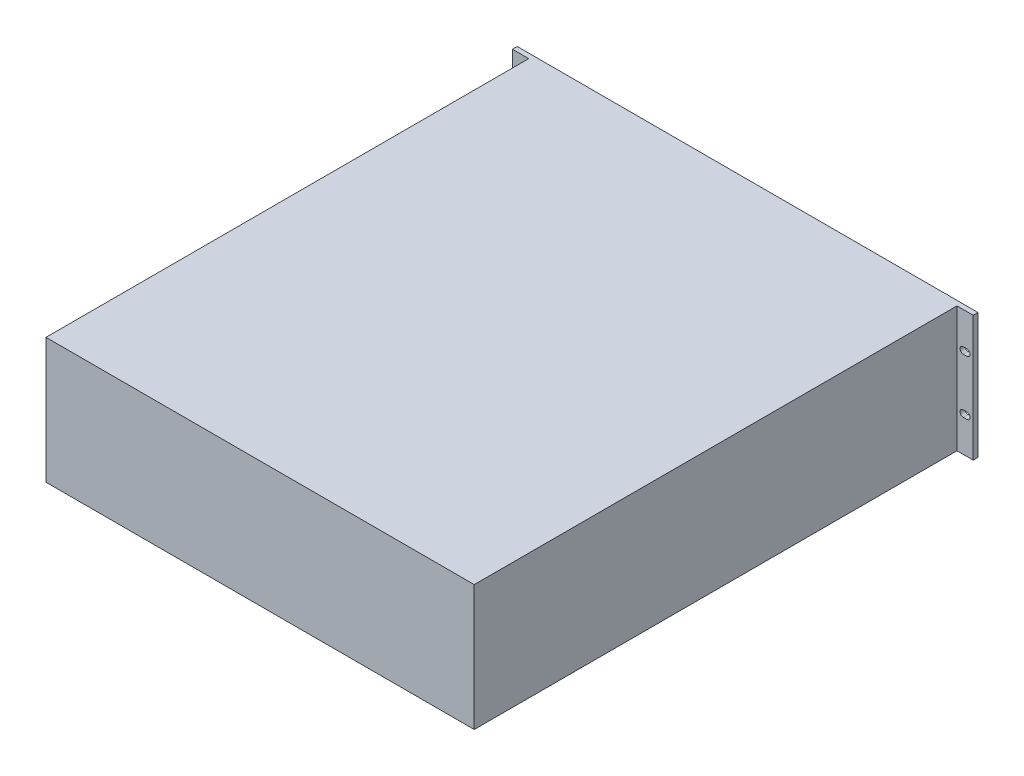
ISO-10303-21;
HEADER;
FILE_DESCRIPTION(('STEP AP214'),'2;1');
FILE_NAME('part.step','',(''),(''),'','','');
FILE_SCHEMA(('AUTOMOTIVE_DESIGN { 1 0 10303 214 1 1 1 1 }'));
ENDSEC;
DATA;
#1=APPLICATION_CONTEXT('core data for automotive mechanical design processes');
#2=APPLICATION_PROTOCOL_DEFINITION('international standard','automotive_design',2000,#1);
#3=PRODUCT_CONTEXT('',#1,'mechanical');
#4=PRODUCT('Part','Part','',(#3));
#5=PRODUCT_RELATED_PRODUCT_CATEGORY('part','',(#4));
#6=PRODUCT_DEFINITION_FORMATION('','',#4);
#7=PRODUCT_DEFINITION_CONTEXT('part definition',#1,'design');
#8=PRODUCT_DEFINITION('design','',#6,#7);
#9=PRODUCT_DEFINITION_SHAPE('','',#8);
#10=(LENGTH_UNIT() NAMED_UNIT(*) SI_UNIT(.MILLI.,.METRE.));
#11=(NAMED_UNIT(*) PLANE_ANGLE_UNIT() SI_UNIT($,.RADIAN.));
#12=(NAMED_UNIT(*) SI_UNIT($,.STERADIAN.) SOLID_ANGLE_UNIT());
#13=UNCERTAINTY_MEASURE_WITH_UNIT(LENGTH_MEASURE(1.E-05),#10,'distance_accuracy_value','');
#14=(GEOMETRIC_REPRESENTATION_CONTEXT(3) GLOBAL_UNCERTAINTY_ASSIGNED_CONTEXT((#13)) GLOBAL_UNIT_ASSIGNED_CONTEXT((#10,
#11,#12)) REPRESENTATION_CONTEXT('',''));
#15=CARTESIAN_POINT('',(0.,0.,0.));
#16=DIRECTION('',(0.,0.,1.));
#17=DIRECTION('',(1.,0.,0.));
#18=AXIS2_PLACEMENT_3D('',#15,#16,#17);
#19=CARTESIAN_POINT('',(0.,0.,0.));
#20=DIRECTION('',(0.,0.,1.));
#21=DIRECTION('',(1.,0.,0.));
#22=AXIS2_PLACEMENT_3D('',#19,#20,#21);
#23=PLANE('',#22);
#24=CARTESIAN_POINT('',(-234.4,-28.575,0.));
#25=DIRECTION('',(0.,0.,1.));
#26=DIRECTION('',(-1.,0.,0.));
#27=AXIS2_PLACEMENT_3D('',#24,#25,#26);
#28=CIRCLE('',#27,3.4);
#29=CARTESIAN_POINT('',(-234.4,-25.175,0.));
#30=VERTEX_POINT('',#29);
#31=CARTESIAN_POINT('',(-234.4,-31.975,0.));
#32=VERTEX_POINT('',#31);
#33=EDGE_CURVE('E57',#30,#32,#28,.T.);
#34=ORIENTED_EDGE('',*,*,#33,.T.);
#35=DIRECTION('',(1.,0.,0.));
#36=VECTOR('',#35,1.);
#37=CARTESIAN_POINT('',(-234.4,-31.975,0.));
#38=LINE('',#37,#36);
#39=CARTESIAN_POINT('',(-230.6,-31.975,0.));
#40=VERTEX_POINT('',#39);
#41=EDGE_CURVE('E233',#32,#40,#38,.T.);
#42=ORIENTED_EDGE('',*,*,#41,.T.);
#43=CARTESIAN_POINT('',(-230.6,-28.575,0.));
#44=DIRECTION('',(0.,0.,1.));
#45=DIRECTION('',(-1.,0.,0.));
#46=AXIS2_PLACEMENT_3D('',#43,#44,#45);
#47=CIRCLE('',#46,3.4);
#48=CARTESIAN_POINT('',(-230.6,-25.175,0.));
#49=VERTEX_POINT('',#48);
#50=EDGE_CURVE('E230',#40,#49,#47,.T.);
#51=ORIENTED_EDGE('',*,*,#50,.T.);
#52=DIRECTION('',(-1.,0.,0.));
#53=VECTOR('',#52,1.);
#54=CARTESIAN_POINT('',(-234.4,-25.175,0.));
#55=LINE('',#54,#53);
#56=EDGE_CURVE('E227',#49,#30,#55,.T.);
#57=ORIENTED_EDGE('',*,*,#56,.T.);
#58=EDGE_LOOP('',(#34,#42,#51,#57));
#59=FACE_BOUND('',#58,.T.);
#60=DIRECTION('',(-1.,0.,0.));
#61=VECTOR('',#60,1.);
#62=CARTESIAN_POINT('',(234.4,25.1750000000001,0.));
#63=LINE('',#62,#61);
#64=CARTESIAN_POINT('',(234.4,25.1750000000001,0.));
#65=VERTEX_POINT('',#64);
#66=CARTESIAN_POINT('',(230.6,25.1750000000001,0.));
#67=VERTEX_POINT('',#66);
#68=EDGE_CURVE('E246',#65,#67,#63,.T.);
#69=ORIENTED_EDGE('',*,*,#68,.F.);
#70=CARTESIAN_POINT('',(234.4,28.575,0.));
#71=DIRECTION('',(0.,0.,-1.));
#72=DIRECTION('',(-1.,0.,0.));
#73=AXIS2_PLACEMENT_3D('',#70,#71,#72);
#74=CIRCLE('',#73,3.39999999999993);
#75=CARTESIAN_POINT('',(234.4,31.9749999999999,0.));
#76=VERTEX_POINT('',#75);
#77=EDGE_CURVE('E244',#76,#65,#74,.T.);
#78=ORIENTED_EDGE('',*,*,#77,.F.);
#79=DIRECTION('',(1.,0.,0.));
#80=VECTOR('',#79,1.);
#81=CARTESIAN_POINT('',(234.4,31.9749999999999,0.));
#82=LINE('',#81,#80);
#83=CARTESIAN_POINT('',(230.6,31.9749999999999,0.));
#84=VERTEX_POINT('',#83);
#85=EDGE_CURVE('E253',#84,#76,#82,.T.);
#86=ORIENTED_EDGE('',*,*,#85,.F.);
#87=CARTESIAN_POINT('',(230.6,28.5750000000001,0.));
#88=DIRECTION('',(0.,0.,-1.));
#89=DIRECTION('',(-1.,0.,0.));
#90=AXIS2_PLACEMENT_3D('',#87,#88,#89);
#91=CIRCLE('',#90,3.39999999999993);
#92=EDGE_CURVE('E250',#67,#84,#91,.T.);
#93=ORIENTED_EDGE('',*,*,#92,.F.);
#94=EDGE_LOOP('',(#69,#78,#86,#93));
#95=FACE_BOUND('',#94,.T.);
#96=DIRECTION('',(1.,0.,0.));
#97=VECTOR('',#96,1.);
#98=CARTESIAN_POINT('',(-234.4,31.975,0.));
#99=LINE('',#98,#97);
#100=CARTESIAN_POINT('',(-234.4,31.975,0.));
#101=VERTEX_POINT('',#100);
#102=CARTESIAN_POINT('',(-230.6,31.975,0.));
#103=VERTEX_POINT('',#102);
#104=EDGE_CURVE('E267',#101,#103,#99,.T.);
#105=ORIENTED_EDGE('',*,*,#104,.F.);
#106=CARTESIAN_POINT('',(-234.4,28.575,0.));
#107=DIRECTION('',(0.,0.,-1.));
#108=DIRECTION('',(-1.,0.,0.));
#109=AXIS2_PLACEMENT_3D('',#106,#107,#108);
#110=CIRCLE('',#109,3.4);
#111=CARTESIAN_POINT('',(-234.4,25.175,0.));
#112=VERTEX_POINT('',#111);
#113=EDGE_CURVE('E223',#112,#101,#110,.T.);
#114=ORIENTED_EDGE('',*,*,#113,.F.);
#115=DIRECTION('',(-1.,0.,0.));
#116=VECTOR('',#115,1.);
#117=CARTESIAN_POINT('',(-234.4,25.175,0.));
#118=LINE('',#117,#116);
#119=CARTESIAN_POINT('',(-230.6,25.175,0.));
#120=VERTEX_POINT('',#119);
#121=EDGE_CURVE('E273',#120,#112,#118,.T.);
#122=ORIENTED_EDGE('',*,*,#121,.F.);
#123=CARTESIAN_POINT('',(-230.6,28.575,0.));
#124=DIRECTION('',(0.,0.,-1.));
#125=DIRECTION('',(-1.,0.,0.));
#126=AXIS2_PLACEMENT_3D('',#123,#124,#125);
#127=CIRCLE('',#126,3.4);
#128=EDGE_CURVE('E270',#103,#120,#127,.T.);
#129=ORIENTED_EDGE('',*,*,#128,.F.);
#130=EDGE_LOOP('',(#105,#114,#122,#129));
#131=FACE_BOUND('',#130,.T.);
#132=DIRECTION('',(1.,0.,0.));
#133=VECTOR('',#132,1.);
#134=CARTESIAN_POINT('',(224.,-65.65,0.));
#135=LINE('',#134,#133);
#136=CARTESIAN_POINT('',(-241.,-65.65,0.));
#137=VERTEX_POINT('',#136);
#138=CARTESIAN_POINT('',(241.,-65.65,0.));
#139=VERTEX_POINT('',#138);
#140=EDGE_CURVE('E321',#137,#139,#135,.T.);
#141=ORIENTED_EDGE('',*,*,#140,.F.);
#142=DIRECTION('',(0.,1.,0.));
#143=VECTOR('',#142,1.);
#144=CARTESIAN_POINT('',(-241.,-65.65,0.));
#145=LINE('',#144,#143);
#146=CARTESIAN_POINT('',(-241.,65.65,0.));
#147=VERTEX_POINT('',#146);
#148=EDGE_CURVE('E288',#137,#147,#145,.T.);
#149=ORIENTED_EDGE('',*,*,#148,.T.);
#150=DIRECTION('',(-1.,0.,0.));
#151=VECTOR('',#150,1.);
#152=CARTESIAN_POINT('',(224.,65.65,0.));
#153=LINE('',#152,#151);
#154=CARTESIAN_POINT('',(241.,65.65,0.));
#155=VERTEX_POINT('',#154);
#156=EDGE_CURVE('E326',#155,#147,#153,.T.);
#157=ORIENTED_EDGE('',*,*,#156,.F.);
#158=DIRECTION('',(0.,-1.,0.));
#159=VECTOR('',#158,1.);
#160=CARTESIAN_POINT('',(241.,-65.65,0.));
#161=LINE('',#160,#159);
#162=EDGE_CURVE('E259',#155,#139,#161,.T.);
#163=ORIENTED_EDGE('',*,*,#162,.T.);
#164=EDGE_LOOP('',(#141,#149,#157,#163));
#165=FACE_BOUND('',#164,.T.);
#166=CARTESIAN_POINT('',(234.4,-28.575,0.));
#167=DIRECTION('',(0.,0.,1.));
#168=DIRECTION('',(-1.,0.,0.));
#169=AXIS2_PLACEMENT_3D('',#166,#167,#168);
#170=CIRCLE('',#169,3.39999999999993);
#171=CARTESIAN_POINT('',(234.4,-31.9749999999999,0.));
#172=VERTEX_POINT('',#171);
#173=CARTESIAN_POINT('',(234.4,-25.1750000000001,0.));
#174=VERTEX_POINT('',#173);
#175=EDGE_CURVE('E49',#172,#174,#170,.T.);
#176=ORIENTED_EDGE('',*,*,#175,.T.);
#177=DIRECTION('',(-1.,0.,0.));
#178=VECTOR('',#177,1.);
#179=CARTESIAN_POINT('',(234.4,-25.1750000000001,0.));
#180=LINE('',#179,#178);
#181=CARTESIAN_POINT('',(230.6,-25.1750000000001,0.));
#182=VERTEX_POINT('',#181);
#183=EDGE_CURVE('E216',#174,#182,#180,.T.);
#184=ORIENTED_EDGE('',*,*,#183,.T.);
#185=CARTESIAN_POINT('',(230.6,-28.5750000000001,0.));
#186=DIRECTION('',(0.,0.,1.));
#187=DIRECTION('',(-1.,0.,0.));
#188=AXIS2_PLACEMENT_3D('',#185,#186,#187);
#189=CIRCLE('',#188,3.39999999999993);
#190=CARTESIAN_POINT('',(230.6,-31.9749999999999,0.));
#191=VERTEX_POINT('',#190);
#192=EDGE_CURVE('E201',#182,#191,#189,.T.);
#193=ORIENTED_EDGE('',*,*,#192,.T.);
#194=DIRECTION('',(1.,0.,0.));
#195=VECTOR('',#194,1.);
#196=CARTESIAN_POINT('',(234.4,-31.9749999999999,0.));
#197=LINE('',#196,#195);
#198=EDGE_CURVE('E211',#191,#172,#197,.T.);
#199=ORIENTED_EDGE('',*,*,#198,.T.);
#200=EDGE_LOOP('',(#176,#184,#193,#199));
#201=FACE_BOUND('',#200,.T.);
#202=ADVANCED_FACE('F34',(#59,#95,#131,#165,#201),#23,.F.);
#203=CARTESIAN_POINT('',(0.,0.,5.));
#204=DIRECTION('',(0.,0.,-1.));
#205=DIRECTION('',(-1.,0.,0.));
#206=AXIS2_PLACEMENT_3D('',#203,#204,#205);
#207=PLANE('',#206);
#208=DIRECTION('',(1.,0.,0.));
#209=VECTOR('',#208,1.);
#210=CARTESIAN_POINT('',(-241.,65.65,5.));
#211=LINE('',#210,#209);
#212=CARTESIAN_POINT('',(224.,65.65,5.));
#213=VERTEX_POINT('',#212);
#214=CARTESIAN_POINT('',(241.,65.65,5.));
#215=VERTEX_POINT('',#214);
#216=EDGE_CURVE('E295',#213,#215,#211,.T.);
#217=ORIENTED_EDGE('',*,*,#216,.F.);
#218=DIRECTION('',(0.,-1.,0.));
#219=VECTOR('',#218,1.);
#220=CARTESIAN_POINT('',(224.,-65.65,5.));
#221=LINE('',#220,#219);
#222=CARTESIAN_POINT('',(224.,-65.65,5.));
#223=VERTEX_POINT('',#222);
#224=EDGE_CURVE('E307',#213,#223,#221,.T.);
#225=ORIENTED_EDGE('',*,*,#224,.T.);
#226=DIRECTION('',(-1.,0.,0.));
#227=VECTOR('',#226,1.);
#228=CARTESIAN_POINT('',(-241.,-65.65,5.));
#229=LINE('',#228,#227);
#230=CARTESIAN_POINT('',(241.,-65.65,5.));
#231=VERTEX_POINT('',#230);
#232=EDGE_CURVE('E289',#231,#223,#229,.T.);
#233=ORIENTED_EDGE('',*,*,#232,.F.);
#234=DIRECTION('',(0.,-1.,0.));
#235=VECTOR('',#234,1.);
#236=CARTESIAN_POINT('',(241.,-65.65,5.));
#237=LINE('',#236,#235);
#238=EDGE_CURVE('E284',#215,#231,#237,.T.);
#239=ORIENTED_EDGE('',*,*,#238,.F.);
#240=EDGE_LOOP('',(#217,#225,#233,#239));
#241=FACE_BOUND('',#240,.T.);
#242=DIRECTION('',(1.,0.,0.));
#243=VECTOR('',#242,1.);
#244=CARTESIAN_POINT('',(0.,31.9749999999999,5.));
#245=LINE('',#244,#243);
#246=CARTESIAN_POINT('',(230.6,31.9749999999999,5.));
#247=VERTEX_POINT('',#246);
#248=CARTESIAN_POINT('',(234.4,31.9749999999999,5.));
#249=VERTEX_POINT('',#248);
#250=EDGE_CURVE('E362',#247,#249,#245,.T.);
#251=ORIENTED_EDGE('',*,*,#250,.T.);
#252=CARTESIAN_POINT('',(234.4,28.575,5.));
#253=DIRECTION('',(0.,0.,-1.));
#254=DIRECTION('',(-1.,0.,0.));
#255=AXIS2_PLACEMENT_3D('',#252,#253,#254);
#256=CIRCLE('',#255,3.39999999999993);
#257=CARTESIAN_POINT('',(234.4,25.1750000000001,5.));
#258=VERTEX_POINT('',#257);
#259=EDGE_CURVE('E365',#249,#258,#256,.T.);
#260=ORIENTED_EDGE('',*,*,#259,.T.);
#261=DIRECTION('',(-1.,0.,0.));
#262=VECTOR('',#261,1.);
#263=CARTESIAN_POINT('',(0.,25.1750000000001,5.));
#264=LINE('',#263,#262);
#265=CARTESIAN_POINT('',(230.6,25.1750000000001,5.));
#266=VERTEX_POINT('',#265);
#267=EDGE_CURVE('E356',#258,#266,#264,.T.);
#268=ORIENTED_EDGE('',*,*,#267,.T.);
#269=CARTESIAN_POINT('',(230.6,28.5750000000001,5.));
#270=DIRECTION('',(0.,0.,-1.));
#271=DIRECTION('',(-1.,0.,0.));
#272=AXIS2_PLACEMENT_3D('',#269,#270,#271);
#273=CIRCLE('',#272,3.39999999999993);
#274=EDGE_CURVE('E359',#266,#247,#273,.T.);
#275=ORIENTED_EDGE('',*,*,#274,.T.);
#276=EDGE_LOOP('',(#251,#260,#268,#275));
#277=FACE_BOUND('',#276,.T.);
#278=CARTESIAN_POINT('',(234.4,-28.575,5.));
#279=DIRECTION('',(0.,0.,-1.));
#280=DIRECTION('',(-1.,0.,0.));
#281=AXIS2_PLACEMENT_3D('',#278,#279,#280);
#282=CIRCLE('',#281,3.39999999999993);
#283=CARTESIAN_POINT('',(234.4,-31.9749999999999,5.));
#284=VERTEX_POINT('',#283);
#285=CARTESIAN_POINT('',(234.4,-25.1750000000001,5.));
#286=VERTEX_POINT('',#285);
#287=EDGE_CURVE('E11',#284,#286,#282,.F.);
#288=ORIENTED_EDGE('',*,*,#287,.F.);
#289=DIRECTION('',(1.,0.,0.));
#290=VECTOR('',#289,1.);
#291=CARTESIAN_POINT('',(0.,-31.9749999999999,5.));
#292=LINE('',#291,#290);
#293=CARTESIAN_POINT('',(230.6,-31.9749999999999,5.));
#294=VERTEX_POINT('',#293);
#295=EDGE_CURVE('E377',#294,#284,#292,.T.);
#296=ORIENTED_EDGE('',*,*,#295,.F.);
#297=CARTESIAN_POINT('',(230.6,-28.5750000000001,5.));
#298=DIRECTION('',(0.,0.,-1.));
#299=DIRECTION('',(-1.,0.,0.));
#300=AXIS2_PLACEMENT_3D('',#297,#298,#299);
#301=CIRCLE('',#300,3.39999999999993);
#302=CARTESIAN_POINT('',(230.6,-25.1750000000001,5.));
#303=VERTEX_POINT('',#302);
#304=EDGE_CURVE('E204',#303,#294,#301,.F.);
#305=ORIENTED_EDGE('',*,*,#304,.F.);
#306=DIRECTION('',(-1.,0.,0.));
#307=VECTOR('',#306,1.);
#308=CARTESIAN_POINT('',(0.,-25.1750000000001,5.));
#309=LINE('',#308,#307);
#310=EDGE_CURVE('E42',#286,#303,#309,.T.);
#311=ORIENTED_EDGE('',*,*,#310,.F.);
#312=EDGE_LOOP('',(#288,#296,#305,#311));
#313=FACE_BOUND('',#312,.T.);
#314=ADVANCED_FACE('F385',(#241,#277,#313),#207,.F.);
#315=CARTESIAN_POINT('',(-224.,-65.65,5.));
#316=VERTEX_POINT('',#315);
#317=CARTESIAN_POINT('',(-241.,-65.65,5.));
#318=VERTEX_POINT('',#317);
#319=EDGE_CURVE('E287',#316,#318,#229,.T.);
#320=ORIENTED_EDGE('',*,*,#319,.F.);
#321=DIRECTION('',(0.,1.,0.));
#322=VECTOR('',#321,1.);
#323=CARTESIAN_POINT('',(-224.,-65.65,5.));
#324=LINE('',#323,#322);
#325=CARTESIAN_POINT('',(-224.,65.65,5.));
#326=VERTEX_POINT('',#325);
#327=EDGE_CURVE('E318',#316,#326,#324,.T.);
#328=ORIENTED_EDGE('',*,*,#327,.T.);
#329=CARTESIAN_POINT('',(-241.,65.65,5.));
#330=VERTEX_POINT('',#329);
#331=EDGE_CURVE('E296',#330,#326,#211,.T.);
#332=ORIENTED_EDGE('',*,*,#331,.F.);
#333=DIRECTION('',(0.,1.,0.));
#334=VECTOR('',#333,1.);
#335=CARTESIAN_POINT('',(-241.,-65.65,5.));
#336=LINE('',#335,#334);
#337=EDGE_CURVE('E292',#318,#330,#336,.T.);
#338=ORIENTED_EDGE('',*,*,#337,.F.);
#339=EDGE_LOOP('',(#320,#328,#332,#338));
#340=FACE_BOUND('',#339,.T.);
#341=DIRECTION('',(-1.,0.,0.));
#342=VECTOR('',#341,1.);
#343=CARTESIAN_POINT('',(0.,25.175,5.));
#344=LINE('',#343,#342);
#345=CARTESIAN_POINT('',(-230.6,25.175,5.));
#346=VERTEX_POINT('',#345);
#347=CARTESIAN_POINT('',(-234.4,25.175,5.));
#348=VERTEX_POINT('',#347);
#349=EDGE_CURVE('E350',#346,#348,#344,.T.);
#350=ORIENTED_EDGE('',*,*,#349,.T.);
#351=CARTESIAN_POINT('',(-234.4,28.575,5.));
#352=DIRECTION('',(0.,0.,-1.));
#353=DIRECTION('',(-1.,0.,0.));
#354=AXIS2_PLACEMENT_3D('',#351,#352,#353);
#355=CIRCLE('',#354,3.4);
#356=CARTESIAN_POINT('',(-234.4,31.975,5.));
#357=VERTEX_POINT('',#356);
#358=EDGE_CURVE('E353',#348,#357,#355,.T.);
#359=ORIENTED_EDGE('',*,*,#358,.T.);
#360=DIRECTION('',(1.,0.,0.));
#361=VECTOR('',#360,1.);
#362=CARTESIAN_POINT('',(0.,31.975,5.));
#363=LINE('',#362,#361);
#364=CARTESIAN_POINT('',(-230.6,31.975,5.));
#365=VERTEX_POINT('',#364);
#366=EDGE_CURVE('E344',#357,#365,#363,.T.);
#367=ORIENTED_EDGE('',*,*,#366,.T.);
#368=CARTESIAN_POINT('',(-230.6,28.575,5.));
#369=DIRECTION('',(0.,0.,-1.));
#370=DIRECTION('',(-1.,0.,0.));
#371=AXIS2_PLACEMENT_3D('',#368,#369,#370);
#372=CIRCLE('',#371,3.4);
#373=EDGE_CURVE('E347',#365,#346,#372,.T.);
#374=ORIENTED_EDGE('',*,*,#373,.T.);
#375=EDGE_LOOP('',(#350,#359,#367,#374));
#376=FACE_BOUND('',#375,.T.);
#377=CARTESIAN_POINT('',(-234.4,-28.575,5.));
#378=DIRECTION('',(0.,0.,-1.));
#379=DIRECTION('',(-1.,0.,0.));
#380=AXIS2_PLACEMENT_3D('',#377,#378,#379);
#381=CIRCLE('',#380,3.4);
#382=CARTESIAN_POINT('',(-234.4,-25.175,5.));
#383=VERTEX_POINT('',#382);
#384=CARTESIAN_POINT('',(-234.4,-31.975,5.));
#385=VERTEX_POINT('',#384);
#386=EDGE_CURVE('E375',#383,#385,#381,.F.);
#387=ORIENTED_EDGE('',*,*,#386,.F.);
#388=DIRECTION('',(-1.,0.,0.));
#389=VECTOR('',#388,1.);
#390=CARTESIAN_POINT('',(0.,-25.175,5.));
#391=LINE('',#390,#389);
#392=CARTESIAN_POINT('',(-230.6,-25.175,5.));
#393=VERTEX_POINT('',#392);
#394=EDGE_CURVE('E368',#393,#383,#391,.T.);
#395=ORIENTED_EDGE('',*,*,#394,.F.);
#396=CARTESIAN_POINT('',(-230.6,-28.575,5.));
#397=DIRECTION('',(0.,0.,-1.));
#398=DIRECTION('',(-1.,0.,0.));
#399=AXIS2_PLACEMENT_3D('',#396,#397,#398);
#400=CIRCLE('',#399,3.4);
#401=CARTESIAN_POINT('',(-230.6,-31.975,5.));
#402=VERTEX_POINT('',#401);
#403=EDGE_CURVE('E370',#402,#393,#400,.F.);
#404=ORIENTED_EDGE('',*,*,#403,.F.);
#405=DIRECTION('',(1.,0.,0.));
#406=VECTOR('',#405,1.);
#407=CARTESIAN_POINT('',(0.,-31.975,5.));
#408=LINE('',#407,#406);
#409=EDGE_CURVE('E373',#385,#402,#408,.T.);
#410=ORIENTED_EDGE('',*,*,#409,.F.);
#411=EDGE_LOOP('',(#387,#395,#404,#410));
#412=FACE_BOUND('',#411,.T.);
#413=ADVANCED_FACE('F406',(#340,#376,#412),#207,.F.);
#414=CARTESIAN_POINT('',(-224.,-65.65,510.));
#415=DIRECTION('',(1.,0.,0.));
#416=DIRECTION('',(0.,0.,-1.));
#417=AXIS2_PLACEMENT_3D('',#414,#415,#416);
#418=PLANE('',#417);
#419=ORIENTED_EDGE('',*,*,#327,.F.);
#420=DIRECTION('',(0.,0.,-1.));
#421=VECTOR('',#420,1.);
#422=CARTESIAN_POINT('',(-224.,-65.65,510.));
#423=LINE('',#422,#421);
#424=CARTESIAN_POINT('',(-224.,-65.65,510.));
#425=VERTEX_POINT('',#424);
#426=EDGE_CURVE('E341',#425,#316,#423,.T.);
#427=ORIENTED_EDGE('',*,*,#426,.F.);
#428=DIRECTION('',(0.,-1.,0.));
#429=VECTOR('',#428,1.);
#430=CARTESIAN_POINT('',(-224.,-65.65,510.));
#431=LINE('',#430,#429);
#432=CARTESIAN_POINT('',(-224.,65.65,510.));
#433=VERTEX_POINT('',#432);
#434=EDGE_CURVE('E322',#433,#425,#431,.T.);
#435=ORIENTED_EDGE('',*,*,#434,.F.);
#436=DIRECTION('',(0.,0.,-1.));
#437=VECTOR('',#436,1.);
#438=CARTESIAN_POINT('',(-224.,65.65,510.));
#439=LINE('',#438,#437);
#440=EDGE_CURVE('E332',#433,#326,#439,.T.);
#441=ORIENTED_EDGE('',*,*,#440,.T.);
#442=EDGE_LOOP('',(#419,#427,#435,#441));
#443=FACE_BOUND('',#442,.T.);
#444=ADVANCED_FACE('F36',(#443),#418,.F.);
#445=CARTESIAN_POINT('',(224.,-65.65,510.));
#446=DIRECTION('',(-1.,0.,0.));
#447=DIRECTION('',(0.,0.,1.));
#448=AXIS2_PLACEMENT_3D('',#445,#446,#447);
#449=PLANE('',#448);
#450=ORIENTED_EDGE('',*,*,#224,.F.);
#451=DIRECTION('',(0.,0.,-1.));
#452=VECTOR('',#451,1.);
#453=CARTESIAN_POINT('',(224.,65.65,510.));
#454=LINE('',#453,#452);
#455=CARTESIAN_POINT('',(224.,65.65,510.));
#456=VERTEX_POINT('',#455);
#457=EDGE_CURVE('E336',#456,#213,#454,.T.);
#458=ORIENTED_EDGE('',*,*,#457,.F.);
#459=DIRECTION('',(0.,1.,0.));
#460=VECTOR('',#459,1.);
#461=CARTESIAN_POINT('',(224.,-65.65,510.));
#462=LINE('',#461,#460);
#463=CARTESIAN_POINT('',(224.,-65.65,510.));
#464=VERTEX_POINT('',#463);
#465=EDGE_CURVE('E328',#464,#456,#462,.T.);
#466=ORIENTED_EDGE('',*,*,#465,.F.);
#467=DIRECTION('',(0.,0.,-1.));
#468=VECTOR('',#467,1.);
#469=CARTESIAN_POINT('',(224.,-65.65,510.));
#470=LINE('',#469,#468);
#471=EDGE_CURVE('E339',#464,#223,#470,.T.);
#472=ORIENTED_EDGE('',*,*,#471,.T.);
#473=EDGE_LOOP('',(#450,#458,#466,#472));
#474=FACE_BOUND('',#473,.T.);
#475=ADVANCED_FACE('F419',(#474),#449,.F.);
#476=CARTESIAN_POINT('',(224.,-65.65,510.));
#477=DIRECTION('',(0.,1.,0.));
#478=DIRECTION('',(-1.,0.,0.));
#479=AXIS2_PLACEMENT_3D('',#476,#477,#478);
#480=PLANE('',#479);
#481=ORIENTED_EDGE('',*,*,#140,.T.);
#482=DIRECTION('',(0.,0.,-1.));
#483=VECTOR('',#482,1.);
#484=CARTESIAN_POINT('',(241.,-65.65,5.));
#485=LINE('',#484,#483);
#486=EDGE_CURVE('E299',#231,#139,#485,.T.);
#487=ORIENTED_EDGE('',*,*,#486,.F.);
#488=ORIENTED_EDGE('',*,*,#232,.T.);
#489=ORIENTED_EDGE('',*,*,#471,.F.);
#490=DIRECTION('',(1.,0.,0.));
#491=VECTOR('',#490,1.);
#492=CARTESIAN_POINT('',(224.,-65.65,510.));
#493=LINE('',#492,#491);
#494=EDGE_CURVE('E325',#425,#464,#493,.T.);
#495=ORIENTED_EDGE('',*,*,#494,.F.);
#496=ORIENTED_EDGE('',*,*,#426,.T.);
#497=ORIENTED_EDGE('',*,*,#319,.T.);
#498=DIRECTION('',(0.,0.,-1.));
#499=VECTOR('',#498,1.);
#500=CARTESIAN_POINT('',(-241.,-65.65,5.));
#501=LINE('',#500,#499);
#502=EDGE_CURVE('E311',#318,#137,#501,.T.);
#503=ORIENTED_EDGE('',*,*,#502,.T.);
#504=EDGE_LOOP('',(#481,#487,#488,#489,#495,#496,#497,#503));
#505=FACE_BOUND('',#504,.T.);
#506=ADVANCED_FACE('F417',(#505),#480,.F.);
#507=CARTESIAN_POINT('',(224.,65.65,510.));
#508=DIRECTION('',(0.,-1.,0.));
#509=DIRECTION('',(1.,0.,0.));
#510=AXIS2_PLACEMENT_3D('',#507,#508,#509);
#511=PLANE('',#510);
#512=ORIENTED_EDGE('',*,*,#156,.T.);
#513=DIRECTION('',(0.,0.,-1.));
#514=VECTOR('',#513,1.);
#515=CARTESIAN_POINT('',(-241.,65.65,5.));
#516=LINE('',#515,#514);
#517=EDGE_CURVE('E308',#330,#147,#516,.T.);
#518=ORIENTED_EDGE('',*,*,#517,.F.);
#519=ORIENTED_EDGE('',*,*,#331,.T.);
#520=ORIENTED_EDGE('',*,*,#440,.F.);
#521=DIRECTION('',(-1.,0.,0.));
#522=VECTOR('',#521,1.);
#523=CARTESIAN_POINT('',(224.,65.65,510.));
#524=LINE('',#523,#522);
#525=EDGE_CURVE('E330',#456,#433,#524,.T.);
#526=ORIENTED_EDGE('',*,*,#525,.F.);
#527=ORIENTED_EDGE('',*,*,#457,.T.);
#528=ORIENTED_EDGE('',*,*,#216,.T.);
#529=DIRECTION('',(0.,0.,-1.));
#530=VECTOR('',#529,1.);
#531=CARTESIAN_POINT('',(241.,65.65,5.));
#532=LINE('',#531,#530);
#533=EDGE_CURVE('E304',#215,#155,#532,.T.);
#534=ORIENTED_EDGE('',*,*,#533,.T.);
#535=EDGE_LOOP('',(#512,#518,#519,#520,#526,#527,#528,#534));
#536=FACE_BOUND('',#535,.T.);
#537=ADVANCED_FACE('F414',(#536),#511,.F.);
#538=CARTESIAN_POINT('',(0.,0.,510.));
#539=DIRECTION('',(0.,0.,1.));
#540=DIRECTION('',(1.,0.,0.));
#541=AXIS2_PLACEMENT_3D('',#538,#539,#540);
#542=PLANE('',#541);
#543=ORIENTED_EDGE('',*,*,#434,.T.);
#544=ORIENTED_EDGE('',*,*,#494,.T.);
#545=ORIENTED_EDGE('',*,*,#465,.T.);
#546=ORIENTED_EDGE('',*,*,#525,.T.);
#547=EDGE_LOOP('',(#543,#544,#545,#546));
#548=FACE_BOUND('',#547,.T.);
#549=ADVANCED_FACE('F412',(#548),#542,.T.);
#550=CARTESIAN_POINT('',(241.,-65.65,5.));
#551=DIRECTION('',(1.,0.,0.));
#552=DIRECTION('',(0.,0.,-1.));
#553=AXIS2_PLACEMENT_3D('',#550,#551,#552);
#554=PLANE('',#553);
#555=ORIENTED_EDGE('',*,*,#162,.F.);
#556=ORIENTED_EDGE('',*,*,#533,.F.);
#557=ORIENTED_EDGE('',*,*,#238,.T.);
#558=ORIENTED_EDGE('',*,*,#486,.T.);
#559=EDGE_LOOP('',(#555,#556,#557,#558));
#560=FACE_BOUND('',#559,.T.);
#561=ADVANCED_FACE('F432',(#560),#554,.T.);
#562=CARTESIAN_POINT('',(-241.,-65.65,5.));
#563=DIRECTION('',(-1.,0.,0.));
#564=DIRECTION('',(0.,0.,1.));
#565=AXIS2_PLACEMENT_3D('',#562,#563,#564);
#566=PLANE('',#565);
#567=ORIENTED_EDGE('',*,*,#148,.F.);
#568=ORIENTED_EDGE('',*,*,#502,.F.);
#569=ORIENTED_EDGE('',*,*,#337,.T.);
#570=ORIENTED_EDGE('',*,*,#517,.T.);
#571=EDGE_LOOP('',(#567,#568,#569,#570));
#572=FACE_BOUND('',#571,.T.);
#573=ADVANCED_FACE('F452',(#572),#566,.T.);
#574=CARTESIAN_POINT('',(-234.4,28.575,510.));
#575=DIRECTION('',(0.,0.,-1.));
#576=DIRECTION('',(-1.,0.,0.));
#577=AXIS2_PLACEMENT_3D('',#574,#575,#576);
#578=CYLINDRICAL_SURFACE('',#577,3.4);
#579=DIRECTION('',(0.,0.,-1.));
#580=VECTOR('',#579,1.);
#581=CARTESIAN_POINT('',(-234.4,25.175,510.));
#582=LINE('',#581,#580);
#583=EDGE_CURVE('E247',#348,#112,#582,.T.);
#584=ORIENTED_EDGE('',*,*,#583,.T.);
#585=ORIENTED_EDGE('',*,*,#113,.T.);
#586=DIRECTION('',(0.,0.,-1.));
#587=VECTOR('',#586,1.);
#588=CARTESIAN_POINT('',(-234.4,31.975,510.));
#589=LINE('',#588,#587);
#590=EDGE_CURVE('E276',#357,#101,#589,.T.);
#591=ORIENTED_EDGE('',*,*,#590,.F.);
#592=ORIENTED_EDGE('',*,*,#358,.F.);
#593=EDGE_LOOP('',(#584,#585,#591,#592));
#594=FACE_BOUND('',#593,.T.);
#595=ADVANCED_FACE('F454',(#594),#578,.F.);
#596=CARTESIAN_POINT('',(-234.4,25.175,510.));
#597=DIRECTION('',(0.,-1.,0.));
#598=DIRECTION('',(0.,0.,-1.));
#599=AXIS2_PLACEMENT_3D('',#596,#597,#598);
#600=PLANE('',#599);
#601=DIRECTION('',(0.,0.,-1.));
#602=VECTOR('',#601,1.);
#603=CARTESIAN_POINT('',(-230.6,25.175,510.));
#604=LINE('',#603,#602);
#605=EDGE_CURVE('E278',#346,#120,#604,.T.);
#606=ORIENTED_EDGE('',*,*,#605,.T.);
#607=ORIENTED_EDGE('',*,*,#121,.T.);
#608=ORIENTED_EDGE('',*,*,#583,.F.);
#609=ORIENTED_EDGE('',*,*,#349,.F.);
#610=EDGE_LOOP('',(#606,#607,#608,#609));
#611=FACE_BOUND('',#610,.T.);
#612=ADVANCED_FACE('F460',(#611),#600,.F.);
#613=CARTESIAN_POINT('',(-230.6,28.575,510.));
#614=DIRECTION('',(0.,0.,-1.));
#615=DIRECTION('',(-1.,0.,0.));
#616=AXIS2_PLACEMENT_3D('',#613,#614,#615);
#617=CYLINDRICAL_SURFACE('',#616,3.4);
#618=DIRECTION('',(0.,0.,-1.));
#619=VECTOR('',#618,1.);
#620=CARTESIAN_POINT('',(-230.6,31.975,510.));
#621=LINE('',#620,#619);
#622=EDGE_CURVE('E280',#365,#103,#621,.T.);
#623=ORIENTED_EDGE('',*,*,#622,.T.);
#624=ORIENTED_EDGE('',*,*,#128,.T.);
#625=ORIENTED_EDGE('',*,*,#605,.F.);
#626=ORIENTED_EDGE('',*,*,#373,.F.);
#627=EDGE_LOOP('',(#623,#624,#625,#626));
#628=FACE_BOUND('',#627,.T.);
#629=ADVANCED_FACE('F468',(#628),#617,.F.);
#630=CARTESIAN_POINT('',(-234.4,31.975,510.));
#631=DIRECTION('',(0.,1.,0.));
#632=DIRECTION('',(0.,0.,1.));
#633=AXIS2_PLACEMENT_3D('',#630,#631,#632);
#634=PLANE('',#633);
#635=ORIENTED_EDGE('',*,*,#590,.T.);
#636=ORIENTED_EDGE('',*,*,#104,.T.);
#637=ORIENTED_EDGE('',*,*,#622,.F.);
#638=ORIENTED_EDGE('',*,*,#366,.F.);
#639=EDGE_LOOP('',(#635,#636,#637,#638));
#640=FACE_BOUND('',#639,.T.);
#641=ADVANCED_FACE('F464',(#640),#634,.F.);
#642=CARTESIAN_POINT('',(234.4,28.575,510.));
#643=DIRECTION('',(0.,0.,-1.));
#644=DIRECTION('',(-1.,0.,0.));
#645=AXIS2_PLACEMENT_3D('',#642,#643,#644);
#646=CYLINDRICAL_SURFACE('',#645,3.39999999999993);
#647=DIRECTION('',(0.,0.,-1.));
#648=VECTOR('',#647,1.);
#649=CARTESIAN_POINT('',(234.4,31.9749999999999,510.));
#650=LINE('',#649,#648);
#651=EDGE_CURVE('E257',#249,#76,#650,.T.);
#652=ORIENTED_EDGE('',*,*,#651,.T.);
#653=ORIENTED_EDGE('',*,*,#77,.T.);
#654=DIRECTION('',(0.,0.,-1.));
#655=VECTOR('',#654,1.);
#656=CARTESIAN_POINT('',(234.4,25.1750000000001,510.));
#657=LINE('',#656,#655);
#658=EDGE_CURVE('E256',#258,#65,#657,.T.);
#659=ORIENTED_EDGE('',*,*,#658,.F.);
#660=ORIENTED_EDGE('',*,*,#259,.F.);
#661=EDGE_LOOP('',(#652,#653,#659,#660));
#662=FACE_BOUND('',#661,.T.);
#663=ADVANCED_FACE('F467',(#662),#646,.F.);
#664=CARTESIAN_POINT('',(234.4,31.9749999999999,510.));
#665=DIRECTION('',(0.,1.,0.));
#666=DIRECTION('',(0.,0.,1.));
#667=AXIS2_PLACEMENT_3D('',#664,#665,#666);
#668=PLANE('',#667);
#669=DIRECTION('',(0.,0.,-1.));
#670=VECTOR('',#669,1.);
#671=CARTESIAN_POINT('',(230.6,31.9749999999999,510.));
#672=LINE('',#671,#670);
#673=EDGE_CURVE('E260',#247,#84,#672,.T.);
#674=ORIENTED_EDGE('',*,*,#673,.T.);
#675=ORIENTED_EDGE('',*,*,#85,.T.);
#676=ORIENTED_EDGE('',*,*,#651,.F.);
#677=ORIENTED_EDGE('',*,*,#250,.F.);
#678=EDGE_LOOP('',(#674,#675,#676,#677));
#679=FACE_BOUND('',#678,.T.);
#680=ADVANCED_FACE('F478',(#679),#668,.F.);
#681=CARTESIAN_POINT('',(230.6,28.5750000000001,510.));
#682=DIRECTION('',(0.,0.,-1.));
#683=DIRECTION('',(-1.,0.,0.));
#684=AXIS2_PLACEMENT_3D('',#681,#682,#683);
#685=CYLINDRICAL_SURFACE('',#684,3.39999999999993);
#686=DIRECTION('',(0.,0.,-1.));
#687=VECTOR('',#686,1.);
#688=CARTESIAN_POINT('',(230.6,25.1750000000001,510.));
#689=LINE('',#688,#687);
#690=EDGE_CURVE('E262',#266,#67,#689,.T.);
#691=ORIENTED_EDGE('',*,*,#690,.T.);
#692=ORIENTED_EDGE('',*,*,#92,.T.);
#693=ORIENTED_EDGE('',*,*,#673,.F.);
#694=ORIENTED_EDGE('',*,*,#274,.F.);
#695=EDGE_LOOP('',(#691,#692,#693,#694));
#696=FACE_BOUND('',#695,.T.);
#697=ADVANCED_FACE('F484',(#696),#685,.F.);
#698=CARTESIAN_POINT('',(234.4,25.1750000000001,510.));
#699=DIRECTION('',(0.,-1.,0.));
#700=DIRECTION('',(0.,0.,-1.));
#701=AXIS2_PLACEMENT_3D('',#698,#699,#700);
#702=PLANE('',#701);
#703=ORIENTED_EDGE('',*,*,#658,.T.);
#704=ORIENTED_EDGE('',*,*,#68,.T.);
#705=ORIENTED_EDGE('',*,*,#690,.F.);
#706=ORIENTED_EDGE('',*,*,#267,.F.);
#707=EDGE_LOOP('',(#703,#704,#705,#706));
#708=FACE_BOUND('',#707,.T.);
#709=ADVANCED_FACE('F480',(#708),#702,.F.);
#710=CARTESIAN_POINT('',(-234.4,-28.575,510.));
#711=DIRECTION('',(0.,0.,-1.));
#712=DIRECTION('',(-1.,0.,0.));
#713=AXIS2_PLACEMENT_3D('',#710,#711,#712);
#714=CYLINDRICAL_SURFACE('',#713,3.4);
#715=ORIENTED_EDGE('',*,*,#386,.T.);
#716=DIRECTION('',(0.,0.,-1.));
#717=VECTOR('',#716,1.);
#718=CARTESIAN_POINT('',(-234.4,-31.975,510.));
#719=LINE('',#718,#717);
#720=EDGE_CURVE('E237',#385,#32,#719,.T.);
#721=ORIENTED_EDGE('',*,*,#720,.T.);
#722=ORIENTED_EDGE('',*,*,#33,.F.);
#723=DIRECTION('',(0.,0.,-1.));
#724=VECTOR('',#723,1.);
#725=CARTESIAN_POINT('',(-234.4,-25.175,510.));
#726=LINE('',#725,#724);
#727=EDGE_CURVE('E236',#383,#30,#726,.T.);
#728=ORIENTED_EDGE('',*,*,#727,.F.);
#729=EDGE_LOOP('',(#715,#721,#722,#728));
#730=FACE_BOUND('',#729,.T.);
#731=ADVANCED_FACE('F483',(#730),#714,.F.);
#732=CARTESIAN_POINT('',(-234.4,-31.975,510.));
#733=DIRECTION('',(0.,1.,0.));
#734=DIRECTION('',(0.,0.,1.));
#735=AXIS2_PLACEMENT_3D('',#732,#733,#734);
#736=PLANE('',#735);
#737=ORIENTED_EDGE('',*,*,#409,.T.);
#738=DIRECTION('',(0.,0.,-1.));
#739=VECTOR('',#738,1.);
#740=CARTESIAN_POINT('',(-230.6,-31.975,510.));
#741=LINE('',#740,#739);
#742=EDGE_CURVE('E239',#402,#40,#741,.T.);
#743=ORIENTED_EDGE('',*,*,#742,.T.);
#744=ORIENTED_EDGE('',*,*,#41,.F.);
#745=ORIENTED_EDGE('',*,*,#720,.F.);
#746=EDGE_LOOP('',(#737,#743,#744,#745));
#747=FACE_BOUND('',#746,.T.);
#748=ADVANCED_FACE('F493',(#747),#736,.T.);
#749=CARTESIAN_POINT('',(-230.6,-28.575,510.));
#750=DIRECTION('',(0.,0.,-1.));
#751=DIRECTION('',(-1.,0.,0.));
#752=AXIS2_PLACEMENT_3D('',#749,#750,#751);
#753=CYLINDRICAL_SURFACE('',#752,3.4);
#754=ORIENTED_EDGE('',*,*,#403,.T.);
#755=DIRECTION('',(0.,0.,-1.));
#756=VECTOR('',#755,1.);
#757=CARTESIAN_POINT('',(-230.6,-25.175,510.));
#758=LINE('',#757,#756);
#759=EDGE_CURVE('E241',#393,#49,#758,.T.);
#760=ORIENTED_EDGE('',*,*,#759,.T.);
#761=ORIENTED_EDGE('',*,*,#50,.F.);
#762=ORIENTED_EDGE('',*,*,#742,.F.);
#763=EDGE_LOOP('',(#754,#760,#761,#762));
#764=FACE_BOUND('',#763,.T.);
#765=ADVANCED_FACE('F395',(#764),#753,.F.);
#766=CARTESIAN_POINT('',(-234.4,-25.175,510.));
#767=DIRECTION('',(0.,-1.,0.));
#768=DIRECTION('',(0.,0.,-1.));
#769=AXIS2_PLACEMENT_3D('',#766,#767,#768);
#770=PLANE('',#769);
#771=ORIENTED_EDGE('',*,*,#394,.T.);
#772=ORIENTED_EDGE('',*,*,#727,.T.);
#773=ORIENTED_EDGE('',*,*,#56,.F.);
#774=ORIENTED_EDGE('',*,*,#759,.F.);
#775=EDGE_LOOP('',(#771,#772,#773,#774));
#776=FACE_BOUND('',#775,.T.);
#777=ADVANCED_FACE('F388',(#776),#770,.T.);
#778=CARTESIAN_POINT('',(234.4,-28.575,510.));
#779=DIRECTION('',(0.,0.,-1.));
#780=DIRECTION('',(-1.,0.,0.));
#781=AXIS2_PLACEMENT_3D('',#778,#779,#780);
#782=CYLINDRICAL_SURFACE('',#781,3.39999999999993);
#783=ORIENTED_EDGE('',*,*,#287,.T.);
#784=DIRECTION('',(0.,0.,-1.));
#785=VECTOR('',#784,1.);
#786=CARTESIAN_POINT('',(234.4,-25.1750000000001,510.));
#787=LINE('',#786,#785);
#788=EDGE_CURVE('E221',#286,#174,#787,.T.);
#789=ORIENTED_EDGE('',*,*,#788,.T.);
#790=ORIENTED_EDGE('',*,*,#175,.F.);
#791=DIRECTION('',(0.,0.,-1.));
#792=VECTOR('',#791,1.);
#793=CARTESIAN_POINT('',(234.4,-31.9749999999999,510.));
#794=LINE('',#793,#792);
#795=EDGE_CURVE('E208',#284,#172,#794,.T.);
#796=ORIENTED_EDGE('',*,*,#795,.F.);
#797=EDGE_LOOP('',(#783,#789,#790,#796));
#798=FACE_BOUND('',#797,.T.);
#799=ADVANCED_FACE('F386',(#798),#782,.F.);
#800=CARTESIAN_POINT('',(234.4,-25.1750000000001,510.));
#801=DIRECTION('',(0.,-1.,0.));
#802=DIRECTION('',(0.,0.,-1.));
#803=AXIS2_PLACEMENT_3D('',#800,#801,#802);
#804=PLANE('',#803);
#805=ORIENTED_EDGE('',*,*,#310,.T.);
#806=DIRECTION('',(0.,0.,-1.));
#807=VECTOR('',#806,1.);
#808=CARTESIAN_POINT('',(230.6,-25.1750000000001,510.));
#809=LINE('',#808,#807);
#810=EDGE_CURVE('E207',#303,#182,#809,.T.);
#811=ORIENTED_EDGE('',*,*,#810,.T.);
#812=ORIENTED_EDGE('',*,*,#183,.F.);
#813=ORIENTED_EDGE('',*,*,#788,.F.);
#814=EDGE_LOOP('',(#805,#811,#812,#813));
#815=FACE_BOUND('',#814,.T.);
#816=ADVANCED_FACE('F382',(#815),#804,.T.);
#817=CARTESIAN_POINT('',(230.6,-28.5750000000001,510.));
#818=DIRECTION('',(0.,0.,-1.));
#819=DIRECTION('',(-1.,0.,0.));
#820=AXIS2_PLACEMENT_3D('',#817,#818,#819);
#821=CYLINDRICAL_SURFACE('',#820,3.39999999999993);
#822=ORIENTED_EDGE('',*,*,#304,.T.);
#823=DIRECTION('',(0.,0.,-1.));
#824=VECTOR('',#823,1.);
#825=CARTESIAN_POINT('',(230.6,-31.9749999999999,510.));
#826=LINE('',#825,#824);
#827=EDGE_CURVE('E196',#294,#191,#826,.T.);
#828=ORIENTED_EDGE('',*,*,#827,.T.);
#829=ORIENTED_EDGE('',*,*,#192,.F.);
#830=ORIENTED_EDGE('',*,*,#810,.F.);
#831=EDGE_LOOP('',(#822,#828,#829,#830));
#832=FACE_BOUND('',#831,.T.);
#833=ADVANCED_FACE('F198',(#832),#821,.F.);
#834=CARTESIAN_POINT('',(234.4,-31.9749999999999,510.));
#835=DIRECTION('',(0.,1.,0.));
#836=DIRECTION('',(0.,0.,1.));
#837=AXIS2_PLACEMENT_3D('',#834,#835,#836);
#838=PLANE('',#837);
#839=ORIENTED_EDGE('',*,*,#295,.T.);
#840=ORIENTED_EDGE('',*,*,#795,.T.);
#841=ORIENTED_EDGE('',*,*,#198,.F.);
#842=ORIENTED_EDGE('',*,*,#827,.F.);
#843=EDGE_LOOP('',(#839,#840,#841,#842));
#844=FACE_BOUND('',#843,.T.);
#845=ADVANCED_FACE('F212',(#844),#838,.T.);
#846=CLOSED_SHELL('',(#202,#314,#413,#444,#475,#506,#537,#549,#561,#573,#595,#612,#629,#641,
#663,#680,#697,#709,#731,#748,#765,#777,#799,#816,#833,#845));
#847=MANIFOLD_SOLID_BREP('B2',#846);
#848=ADVANCED_BREP_SHAPE_REPRESENTATION('',(#18,#847),#14);
#849=SHAPE_DEFINITION_REPRESENTATION(#9,#848);
ENDSEC;
END-ISO-10303-21;
